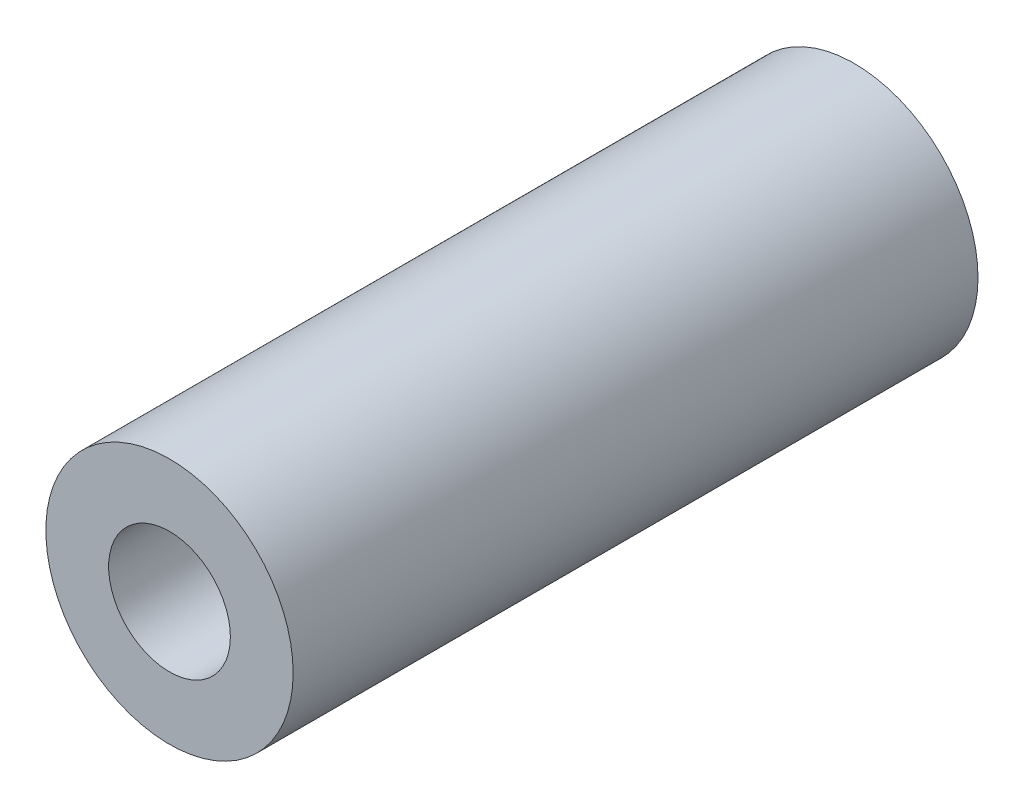
ISO-10303-21;
HEADER;
FILE_DESCRIPTION(('STEP AP214'),'2;1');
FILE_NAME('part.step','',(''),(''),'','','');
FILE_SCHEMA(('AUTOMOTIVE_DESIGN { 1 0 10303 214 1 1 1 1 }'));
ENDSEC;
DATA;
#1=APPLICATION_CONTEXT('core data for automotive mechanical design processes');
#2=APPLICATION_PROTOCOL_DEFINITION('international standard','automotive_design',2000,#1);
#3=PRODUCT_CONTEXT('',#1,'mechanical');
#4=PRODUCT('Part','Part','',(#3));
#5=PRODUCT_RELATED_PRODUCT_CATEGORY('part','',(#4));
#6=PRODUCT_DEFINITION_FORMATION('','',#4);
#7=PRODUCT_DEFINITION_CONTEXT('part definition',#1,'design');
#8=PRODUCT_DEFINITION('design','',#6,#7);
#9=PRODUCT_DEFINITION_SHAPE('','',#8);
#10=(LENGTH_UNIT() NAMED_UNIT(*) SI_UNIT(.MILLI.,.METRE.));
#11=(NAMED_UNIT(*) PLANE_ANGLE_UNIT() SI_UNIT($,.RADIAN.));
#12=(NAMED_UNIT(*) SI_UNIT($,.STERADIAN.) SOLID_ANGLE_UNIT());
#13=UNCERTAINTY_MEASURE_WITH_UNIT(LENGTH_MEASURE(1.E-05),#10,'distance_accuracy_value','');
#14=(GEOMETRIC_REPRESENTATION_CONTEXT(3) GLOBAL_UNCERTAINTY_ASSIGNED_CONTEXT((#13)) GLOBAL_UNIT_ASSIGNED_CONTEXT((#10,
#11,#12)) REPRESENTATION_CONTEXT('',''));
#15=CARTESIAN_POINT('',(0.,0.,0.));
#16=DIRECTION('',(0.,0.,1.));
#17=DIRECTION('',(1.,0.,0.));
#18=AXIS2_PLACEMENT_3D('',#15,#16,#17);
#19=CARTESIAN_POINT('',(0.,0.,18.));
#20=DIRECTION('',(0.,0.,1.));
#21=DIRECTION('',(1.,0.,0.));
#22=AXIS2_PLACEMENT_3D('',#19,#20,#21);
#23=PLANE('',#22);
#24=CARTESIAN_POINT('',(0.,0.,18.));
#25=DIRECTION('',(0.,0.,1.));
#26=DIRECTION('',(1.,0.,0.));
#27=AXIS2_PLACEMENT_3D('',#24,#25,#26);
#28=CIRCLE('',#27,3.25);
#29=CARTESIAN_POINT('',(3.25,0.,18.));
#30=VERTEX_POINT('',#29);
#31=EDGE_CURVE('E10',#30,#30,#28,.T.);
#32=ORIENTED_EDGE('',*,*,#31,.T.);
#33=EDGE_LOOP('',(#32));
#34=FACE_BOUND('',#33,.T.);
#35=CARTESIAN_POINT('',(0.,0.,18.));
#36=DIRECTION('',(0.,0.,1.));
#37=DIRECTION('',(1.,0.,0.));
#38=AXIS2_PLACEMENT_3D('',#35,#36,#37);
#39=CIRCLE('',#38,1.6);
#40=CARTESIAN_POINT('',(1.6,0.,18.));
#41=VERTEX_POINT('',#40);
#42=EDGE_CURVE('E43',#41,#41,#39,.T.);
#43=ORIENTED_EDGE('',*,*,#42,.F.);
#44=EDGE_LOOP('',(#43));
#45=FACE_BOUND('',#44,.T.);
#46=ADVANCED_FACE('F32',(#34,#45),#23,.T.);
#47=CARTESIAN_POINT('',(0.,0.,0.));
#48=DIRECTION('',(0.,0.,1.));
#49=DIRECTION('',(1.,0.,0.));
#50=AXIS2_PLACEMENT_3D('',#47,#48,#49);
#51=PLANE('',#50);
#52=CARTESIAN_POINT('',(0.,0.,0.));
#53=DIRECTION('',(0.,0.,1.));
#54=DIRECTION('',(1.,0.,0.));
#55=AXIS2_PLACEMENT_3D('',#52,#53,#54);
#56=CIRCLE('',#55,3.25);
#57=CARTESIAN_POINT('',(3.25,0.,0.));
#58=VERTEX_POINT('',#57);
#59=EDGE_CURVE('E36',#58,#58,#56,.T.);
#60=ORIENTED_EDGE('',*,*,#59,.F.);
#61=EDGE_LOOP('',(#60));
#62=FACE_BOUND('',#61,.T.);
#63=CARTESIAN_POINT('',(0.,0.,0.));
#64=DIRECTION('',(0.,0.,1.));
#65=DIRECTION('',(1.,0.,0.));
#66=AXIS2_PLACEMENT_3D('',#63,#64,#65);
#67=CIRCLE('',#66,1.6);
#68=CARTESIAN_POINT('',(1.6,0.,0.));
#69=VERTEX_POINT('',#68);
#70=EDGE_CURVE('E45',#69,#69,#67,.T.);
#71=ORIENTED_EDGE('',*,*,#70,.T.);
#72=EDGE_LOOP('',(#71));
#73=FACE_BOUND('',#72,.T.);
#74=ADVANCED_FACE('F55',(#62,#73),#51,.F.);
#75=CARTESIAN_POINT('',(0.,0.,18.));
#76=DIRECTION('',(0.,0.,-1.));
#77=DIRECTION('',(-1.,0.,0.));
#78=AXIS2_PLACEMENT_3D('',#75,#76,#77);
#79=CYLINDRICAL_SURFACE('',#78,3.25);
#80=ORIENTED_EDGE('',*,*,#31,.F.);
#81=EDGE_LOOP('',(#80));
#82=FACE_BOUND('',#81,.T.);
#83=ORIENTED_EDGE('',*,*,#59,.T.);
#84=EDGE_LOOP('',(#83));
#85=FACE_BOUND('',#84,.T.);
#86=ADVANCED_FACE('F34',(#82,#85),#79,.T.);
#87=CARTESIAN_POINT('',(0.,0.,18.));
#88=DIRECTION('',(0.,0.,-1.));
#89=DIRECTION('',(-1.,0.,0.));
#90=AXIS2_PLACEMENT_3D('',#87,#88,#89);
#91=CYLINDRICAL_SURFACE('',#90,1.6);
#92=ORIENTED_EDGE('',*,*,#42,.T.);
#93=EDGE_LOOP('',(#92));
#94=FACE_BOUND('',#93,.T.);
#95=ORIENTED_EDGE('',*,*,#70,.F.);
#96=EDGE_LOOP('',(#95));
#97=FACE_BOUND('',#96,.T.);
#98=ADVANCED_FACE('F51',(#94,#97),#91,.F.);
#99=CLOSED_SHELL('',(#46,#74,#86,#98));
#100=MANIFOLD_SOLID_BREP('B2',#99);
#101=ADVANCED_BREP_SHAPE_REPRESENTATION('',(#18,#100),#14);
#102=SHAPE_DEFINITION_REPRESENTATION(#9,#101);
ENDSEC;
END-ISO-10303-21;
